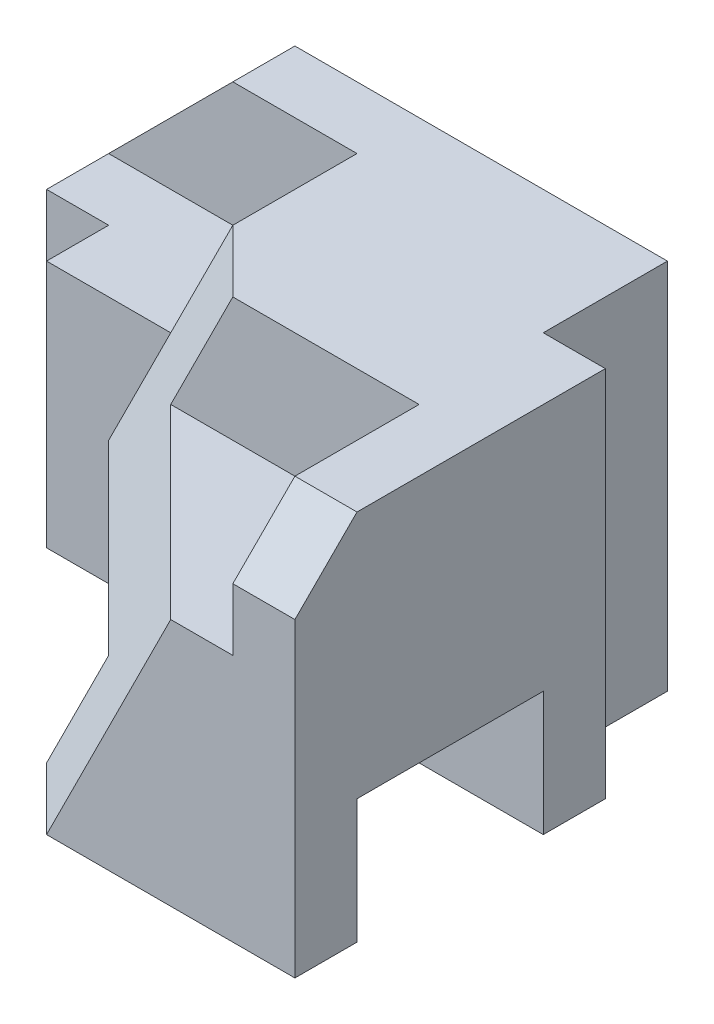
ISO-10303-21;
HEADER;
FILE_DESCRIPTION(('STEP AP214'),'2;1');
FILE_NAME('part.step','',(''),(''),'','','');
FILE_SCHEMA(('AUTOMOTIVE_DESIGN { 1 0 10303 214 1 1 1 1 }'));
ENDSEC;
DATA;
#1=APPLICATION_CONTEXT('core data for automotive mechanical design processes');
#2=APPLICATION_PROTOCOL_DEFINITION('international standard','automotive_design',2000,#1);
#3=PRODUCT_CONTEXT('',#1,'mechanical');
#4=PRODUCT('Part','Part','',(#3));
#5=PRODUCT_RELATED_PRODUCT_CATEGORY('part','',(#4));
#6=PRODUCT_DEFINITION_FORMATION('','',#4);
#7=PRODUCT_DEFINITION_CONTEXT('part definition',#1,'design');
#8=PRODUCT_DEFINITION('design','',#6,#7);
#9=PRODUCT_DEFINITION_SHAPE('','',#8);
#10=(LENGTH_UNIT() NAMED_UNIT(*) SI_UNIT(.MILLI.,.METRE.));
#11=(NAMED_UNIT(*) PLANE_ANGLE_UNIT() SI_UNIT($,.RADIAN.));
#12=(NAMED_UNIT(*) SI_UNIT($,.STERADIAN.) SOLID_ANGLE_UNIT());
#13=UNCERTAINTY_MEASURE_WITH_UNIT(LENGTH_MEASURE(1.E-05),#10,'distance_accuracy_value','');
#14=(GEOMETRIC_REPRESENTATION_CONTEXT(3) GLOBAL_UNCERTAINTY_ASSIGNED_CONTEXT((#13)) GLOBAL_UNIT_ASSIGNED_CONTEXT((#10,
#11,#12)) REPRESENTATION_CONTEXT('',''));
#15=CARTESIAN_POINT('',(0.,0.,0.));
#16=DIRECTION('',(0.,0.,1.));
#17=DIRECTION('',(1.,0.,0.));
#18=AXIS2_PLACEMENT_3D('',#15,#16,#17);
#19=CARTESIAN_POINT('',(0.,6.,0.));
#20=DIRECTION('',(0.,-1.,0.));
#21=DIRECTION('',(0.,0.,-1.));
#22=AXIS2_PLACEMENT_3D('',#19,#20,#21);
#23=PLANE('',#22);
#24=DIRECTION('',(0.707106781186548,0.,0.707106781186548));
#25=VECTOR('',#24,1.);
#26=CARTESIAN_POINT('',(0.499999999999989,6.,0.50000000000001));
#27=LINE('',#26,#25);
#28=CARTESIAN_POINT('',(-0.500000000000011,6.,-0.49999999999999));
#29=VERTEX_POINT('',#28);
#30=CARTESIAN_POINT('',(0.499999999999989,6.,0.50000000000001));
#31=VERTEX_POINT('',#30);
#32=EDGE_CURVE('E330',#29,#31,#27,.T.);
#33=ORIENTED_EDGE('',*,*,#32,.T.);
#34=DIRECTION('',(-1.,0.,0.));
#35=VECTOR('',#34,1.);
#36=CARTESIAN_POINT('',(3.49999999999998,6.,0.50000000000001));
#37=LINE('',#36,#35);
#38=CARTESIAN_POINT('',(3.49999999999998,6.,0.50000000000001));
#39=VERTEX_POINT('',#38);
#40=EDGE_CURVE('E203',#39,#31,#37,.T.);
#41=ORIENTED_EDGE('',*,*,#40,.F.);
#42=DIRECTION('',(0.,0.,-1.));
#43=VECTOR('',#42,1.);
#44=CARTESIAN_POINT('',(3.49999999999998,6.,3.50000000000001));
#45=LINE('',#44,#43);
#46=CARTESIAN_POINT('',(3.49999999999998,6.,2.50000000000001));
#47=VERTEX_POINT('',#46);
#48=EDGE_CURVE('E317',#47,#39,#45,.T.);
#49=ORIENTED_EDGE('',*,*,#48,.F.);
#50=DIRECTION('',(1.,0.,0.));
#51=VECTOR('',#50,1.);
#52=CARTESIAN_POINT('',(0.,6.,2.50000000000001));
#53=LINE('',#52,#51);
#54=CARTESIAN_POINT('',(4.5,6.,2.50000000000001));
#55=VERTEX_POINT('',#54);
#56=EDGE_CURVE('E268',#47,#55,#53,.T.);
#57=ORIENTED_EDGE('',*,*,#56,.T.);
#58=DIRECTION('',(0.,0.,-1.));
#59=VECTOR('',#58,1.);
#60=CARTESIAN_POINT('',(4.5,6.,3.50000000000001));
#61=LINE('',#60,#59);
#62=CARTESIAN_POINT('',(4.5,6.,-1.5));
#63=VERTEX_POINT('',#62);
#64=EDGE_CURVE('E246',#55,#63,#61,.T.);
#65=ORIENTED_EDGE('',*,*,#64,.T.);
#66=DIRECTION('',(1.,0.,0.));
#67=VECTOR('',#66,1.);
#68=CARTESIAN_POINT('',(4.5,6.,-1.5));
#69=LINE('',#68,#67);
#70=CARTESIAN_POINT('',(3.5,6.,-1.5));
#71=VERTEX_POINT('',#70);
#72=EDGE_CURVE('E303',#71,#63,#69,.T.);
#73=ORIENTED_EDGE('',*,*,#72,.F.);
#74=DIRECTION('',(0.,0.,1.));
#75=VECTOR('',#74,1.);
#76=CARTESIAN_POINT('',(3.5,6.,-3.5));
#77=LINE('',#76,#75);
#78=CARTESIAN_POINT('',(3.5,6.,-3.5));
#79=VERTEX_POINT('',#78);
#80=EDGE_CURVE('E298',#79,#71,#77,.T.);
#81=ORIENTED_EDGE('',*,*,#80,.F.);
#82=DIRECTION('',(-1.,0.,0.));
#83=VECTOR('',#82,1.);
#84=CARTESIAN_POINT('',(-4.50000000000001,6.,-3.5));
#85=LINE('',#84,#83);
#86=CARTESIAN_POINT('',(-2.5,6.,-3.5));
#87=VERTEX_POINT('',#86);
#88=EDGE_CURVE('E249',#79,#87,#85,.T.);
#89=ORIENTED_EDGE('',*,*,#88,.T.);
#90=DIRECTION('',(0.,0.,1.));
#91=VECTOR('',#90,1.);
#92=CARTESIAN_POINT('',(-2.5,6.,0.));
#93=LINE('',#92,#91);
#94=CARTESIAN_POINT('',(-2.5,6.,-2.49999999999999));
#95=VERTEX_POINT('',#94);
#96=EDGE_CURVE('E277',#87,#95,#93,.T.);
#97=ORIENTED_EDGE('',*,*,#96,.T.);
#98=DIRECTION('',(-1.,0.,0.));
#99=VECTOR('',#98,1.);
#100=CARTESIAN_POINT('',(-2.5,6.,-2.49999999999999));
#101=LINE('',#100,#99);
#102=CARTESIAN_POINT('',(-0.500000000000011,6.,-2.49999999999999));
#103=VERTEX_POINT('',#102);
#104=EDGE_CURVE('E53',#103,#95,#101,.T.);
#105=ORIENTED_EDGE('',*,*,#104,.F.);
#106=DIRECTION('',(0.,0.,-1.));
#107=VECTOR('',#106,1.);
#108=CARTESIAN_POINT('',(-0.500000000000011,6.,0.50000000000001));
#109=LINE('',#108,#107);
#110=EDGE_CURVE('E207',#29,#103,#109,.T.);
#111=ORIENTED_EDGE('',*,*,#110,.F.);
#112=EDGE_LOOP('',(#33,#41,#49,#57,#65,#73,#81,#89,#97,#105,#111));
#113=FACE_BOUND('',#112,.T.);
#114=ADVANCED_FACE('F36',(#113),#23,.F.);
#115=CARTESIAN_POINT('',(3.49999999999998,6.,0.50000000000001));
#116=DIRECTION('',(0.,0.,-1.));
#117=DIRECTION('',(0.,1.,0.));
#118=AXIS2_PLACEMENT_3D('',#115,#116,#117);
#119=PLANE('',#118);
#120=DIRECTION('',(-0.447213595499962,-0.894427190999914,0.));
#121=VECTOR('',#120,1.);
#122=CARTESIAN_POINT('',(-0.500000000000021,4.,0.50000000000001));
#123=LINE('',#122,#121);
#124=CARTESIAN_POINT('',(-0.500000000000021,4.,0.50000000000001));
#125=VERTEX_POINT('',#124);
#126=EDGE_CURVE('E334',#31,#125,#123,.T.);
#127=ORIENTED_EDGE('',*,*,#126,.T.);
#128=DIRECTION('',(-1.,0.,0.));
#129=VECTOR('',#128,1.);
#130=CARTESIAN_POINT('',(3.49999999999998,4.,0.50000000000001));
#131=LINE('',#130,#129);
#132=CARTESIAN_POINT('',(3.49999999999998,4.,0.50000000000001));
#133=VERTEX_POINT('',#132);
#134=EDGE_CURVE('E191',#133,#125,#131,.T.);
#135=ORIENTED_EDGE('',*,*,#134,.F.);
#136=DIRECTION('',(0.,-1.,0.));
#137=VECTOR('',#136,1.);
#138=CARTESIAN_POINT('',(3.49999999999998,6.,0.50000000000001));
#139=LINE('',#138,#137);
#140=EDGE_CURVE('E319',#39,#133,#139,.T.);
#141=ORIENTED_EDGE('',*,*,#140,.F.);
#142=ORIENTED_EDGE('',*,*,#40,.T.);
#143=EDGE_LOOP('',(#127,#135,#141,#142));
#144=FACE_BOUND('',#143,.T.);
#145=ADVANCED_FACE('F328',(#144),#119,.F.);
#146=CARTESIAN_POINT('',(0.,0.,0.));
#147=DIRECTION('',(0.,-1.,0.));
#148=DIRECTION('',(0.,0.,-1.));
#149=AXIS2_PLACEMENT_3D('',#146,#147,#148);
#150=PLANE('',#149);
#151=DIRECTION('',(1.,0.,0.));
#152=VECTOR('',#151,1.);
#153=CARTESIAN_POINT('',(-4.50000000000001,0.,3.50000000000001));
#154=LINE('',#153,#152);
#155=CARTESIAN_POINT('',(0.499999999999997,0.,3.50000000000001));
#156=VERTEX_POINT('',#155);
#157=CARTESIAN_POINT('',(4.5,0.,3.50000000000001));
#158=VERTEX_POINT('',#157);
#159=EDGE_CURVE('E223',#156,#158,#154,.T.);
#160=ORIENTED_EDGE('',*,*,#159,.F.);
#161=DIRECTION('',(-0.707106781186548,0.,-0.707106781186548));
#162=VECTOR('',#161,1.);
#163=CARTESIAN_POINT('',(0.499999999999997,0.,3.50000000000001));
#164=LINE('',#163,#162);
#165=CARTESIAN_POINT('',(-0.500000000000003,0.,2.50000000000001));
#166=VERTEX_POINT('',#165);
#167=EDGE_CURVE('E180',#156,#166,#164,.T.);
#168=ORIENTED_EDGE('',*,*,#167,.T.);
#169=DIRECTION('',(-1.,0.,0.));
#170=VECTOR('',#169,1.);
#171=CARTESIAN_POINT('',(4.5,0.,2.50000000000001));
#172=LINE('',#171,#170);
#173=CARTESIAN_POINT('',(4.5,0.,2.50000000000001));
#174=VERTEX_POINT('',#173);
#175=EDGE_CURVE('E233',#174,#166,#172,.T.);
#176=ORIENTED_EDGE('',*,*,#175,.F.);
#177=DIRECTION('',(0.,0.,-1.));
#178=VECTOR('',#177,1.);
#179=CARTESIAN_POINT('',(4.5,0.,3.50000000000001));
#180=LINE('',#179,#178);
#181=EDGE_CURVE('E253',#158,#174,#180,.T.);
#182=ORIENTED_EDGE('',*,*,#181,.F.);
#183=EDGE_LOOP('',(#160,#168,#176,#182));
#184=FACE_BOUND('',#183,.T.);
#185=ADVANCED_FACE('F395',(#184),#150,.T.);
#186=CARTESIAN_POINT('',(-4.50000000000001,6.,3.50000000000001));
#187=DIRECTION('',(0.,0.,-1.));
#188=DIRECTION('',(-1.,0.,0.));
#189=AXIS2_PLACEMENT_3D('',#186,#187,#188);
#190=PLANE('',#189);
#191=DIRECTION('',(-0.447213595499955,-0.894427190999918,0.));
#192=VECTOR('',#191,1.);
#193=CARTESIAN_POINT('',(2.49999999999998,4.,3.50000000000001));
#194=LINE('',#193,#192);
#195=CARTESIAN_POINT('',(2.49999999999998,4.,3.50000000000001));
#196=VERTEX_POINT('',#195);
#197=EDGE_CURVE('E174',#196,#156,#194,.T.);
#198=ORIENTED_EDGE('',*,*,#197,.T.);
#199=ORIENTED_EDGE('',*,*,#159,.T.);
#200=DIRECTION('',(0.,-1.,0.));
#201=VECTOR('',#200,1.);
#202=CARTESIAN_POINT('',(4.5,6.,3.50000000000001));
#203=LINE('',#202,#201);
#204=CARTESIAN_POINT('',(4.5,5.,3.50000000000001));
#205=VERTEX_POINT('',#204);
#206=EDGE_CURVE('E252',#205,#158,#203,.T.);
#207=ORIENTED_EDGE('',*,*,#206,.F.);
#208=DIRECTION('',(-1.,0.,0.));
#209=VECTOR('',#208,1.);
#210=CARTESIAN_POINT('',(-4.50000000000001,5.,3.50000000000001));
#211=LINE('',#210,#209);
#212=CARTESIAN_POINT('',(3.49999999999998,5.,3.50000000000001));
#213=VERTEX_POINT('',#212);
#214=EDGE_CURVE('E273',#205,#213,#211,.T.);
#215=ORIENTED_EDGE('',*,*,#214,.T.);
#216=DIRECTION('',(0.,1.,0.));
#217=VECTOR('',#216,1.);
#218=CARTESIAN_POINT('',(3.49999999999998,6.,3.50000000000001));
#219=LINE('',#218,#217);
#220=CARTESIAN_POINT('',(3.49999999999998,4.,3.50000000000001));
#221=VERTEX_POINT('',#220);
#222=EDGE_CURVE('E197',#221,#213,#219,.T.);
#223=ORIENTED_EDGE('',*,*,#222,.F.);
#224=DIRECTION('',(-1.,0.,0.));
#225=VECTOR('',#224,1.);
#226=CARTESIAN_POINT('',(3.49999999999998,4.,3.50000000000001));
#227=LINE('',#226,#225);
#228=EDGE_CURVE('E189',#221,#196,#227,.T.);
#229=ORIENTED_EDGE('',*,*,#228,.T.);
#230=EDGE_LOOP('',(#198,#199,#207,#215,#223,#229));
#231=FACE_BOUND('',#230,.T.);
#232=ADVANCED_FACE('F195',(#231),#190,.F.);
#233=CARTESIAN_POINT('',(4.5,0.,2.50000000000001));
#234=DIRECTION('',(0.,0.,1.));
#235=DIRECTION('',(1.,0.,0.));
#236=AXIS2_PLACEMENT_3D('',#233,#234,#235);
#237=PLANE('',#236);
#238=DIRECTION('',(0.447213595499958,0.894427190999916,0.));
#239=VECTOR('',#238,1.);
#240=CARTESIAN_POINT('',(-0.500000000000003,0.,2.50000000000001));
#241=LINE('',#240,#239);
#242=CARTESIAN_POINT('',(0.499999999999997,2.,2.50000000000001));
#243=VERTEX_POINT('',#242);
#244=EDGE_CURVE('E375',#166,#243,#241,.T.);
#245=ORIENTED_EDGE('',*,*,#244,.T.);
#246=DIRECTION('',(-1.,0.,0.));
#247=VECTOR('',#246,1.);
#248=CARTESIAN_POINT('',(4.5,2.,2.50000000000001));
#249=LINE('',#248,#247);
#250=CARTESIAN_POINT('',(4.5,2.,2.50000000000001));
#251=VERTEX_POINT('',#250);
#252=EDGE_CURVE('E229',#251,#243,#249,.T.);
#253=ORIENTED_EDGE('',*,*,#252,.F.);
#254=DIRECTION('',(0.,1.,0.));
#255=VECTOR('',#254,1.);
#256=CARTESIAN_POINT('',(4.5,0.,2.50000000000001));
#257=LINE('',#256,#255);
#258=EDGE_CURVE('E198',#174,#251,#257,.T.);
#259=ORIENTED_EDGE('',*,*,#258,.F.);
#260=ORIENTED_EDGE('',*,*,#175,.T.);
#261=EDGE_LOOP('',(#245,#253,#259,#260));
#262=FACE_BOUND('',#261,.T.);
#263=ADVANCED_FACE('F398',(#262),#237,.F.);
#264=CARTESIAN_POINT('',(4.5,2.,2.50000000000001));
#265=DIRECTION('',(0.,1.,0.));
#266=DIRECTION('',(0.,0.,1.));
#267=AXIS2_PLACEMENT_3D('',#264,#265,#266);
#268=PLANE('',#267);
#269=DIRECTION('',(-0.707106781186548,0.,-0.707106781186546));
#270=VECTOR('',#269,1.);
#271=CARTESIAN_POINT('',(0.499999999999997,2.,2.50000000000001));
#272=LINE('',#271,#270);
#273=CARTESIAN_POINT('',(-2.50000000000001,2.,-0.499999999999989));
#274=VERTEX_POINT('',#273);
#275=EDGE_CURVE('E374',#243,#274,#272,.T.);
#276=ORIENTED_EDGE('',*,*,#275,.T.);
#277=DIRECTION('',(-1.,0.,0.));
#278=VECTOR('',#277,1.);
#279=CARTESIAN_POINT('',(4.5,2.,-0.49999999999999));
#280=LINE('',#279,#278);
#281=CARTESIAN_POINT('',(4.5,2.,-0.49999999999999));
#282=VERTEX_POINT('',#281);
#283=EDGE_CURVE('E226',#282,#274,#280,.T.);
#284=ORIENTED_EDGE('',*,*,#283,.F.);
#285=DIRECTION('',(0.,0.,-1.));
#286=VECTOR('',#285,1.);
#287=CARTESIAN_POINT('',(4.5,2.,2.50000000000001));
#288=LINE('',#287,#286);
#289=EDGE_CURVE('E201',#251,#282,#288,.T.);
#290=ORIENTED_EDGE('',*,*,#289,.F.);
#291=ORIENTED_EDGE('',*,*,#252,.T.);
#292=EDGE_LOOP('',(#276,#284,#290,#291));
#293=FACE_BOUND('',#292,.T.);
#294=ADVANCED_FACE('F467',(#293),#268,.F.);
#295=CARTESIAN_POINT('',(3.49999999999998,4.,3.50000000000001));
#296=DIRECTION('',(0.,-1.,0.));
#297=DIRECTION('',(0.,0.,-1.));
#298=AXIS2_PLACEMENT_3D('',#295,#296,#297);
#299=PLANE('',#298);
#300=DIRECTION('',(0.707106781186548,0.,0.707106781186548));
#301=VECTOR('',#300,1.);
#302=CARTESIAN_POINT('',(-0.500000000000021,4.,0.50000000000001));
#303=LINE('',#302,#301);
#304=EDGE_CURVE('E177',#125,#196,#303,.T.);
#305=ORIENTED_EDGE('',*,*,#304,.T.);
#306=ORIENTED_EDGE('',*,*,#228,.F.);
#307=DIRECTION('',(0.,0.,1.));
#308=VECTOR('',#307,1.);
#309=CARTESIAN_POINT('',(3.49999999999998,4.,3.50000000000001));
#310=LINE('',#309,#308);
#311=EDGE_CURVE('E222',#133,#221,#310,.T.);
#312=ORIENTED_EDGE('',*,*,#311,.F.);
#313=ORIENTED_EDGE('',*,*,#134,.T.);
#314=EDGE_LOOP('',(#305,#306,#312,#313));
#315=FACE_BOUND('',#314,.T.);
#316=ADVANCED_FACE('F187',(#315),#299,.F.);
#317=DIRECTION('',(-1.,0.,0.));
#318=VECTOR('',#317,1.);
#319=CARTESIAN_POINT('',(-3.50000000000001,4.,-0.49999999999999));
#320=LINE('',#319,#318);
#321=CARTESIAN_POINT('',(-1.50000000000001,4.,-0.49999999999999));
#322=VERTEX_POINT('',#321);
#323=CARTESIAN_POINT('',(-3.50000000000001,4.,-0.49999999999999));
#324=VERTEX_POINT('',#323);
#325=EDGE_CURVE('E192',#322,#324,#320,.T.);
#326=ORIENTED_EDGE('',*,*,#325,.F.);
#327=DIRECTION('',(0.,0.,-1.));
#328=VECTOR('',#327,1.);
#329=CARTESIAN_POINT('',(-1.50000000000001,4.,0.50000000000001));
#330=LINE('',#329,#328);
#331=CARTESIAN_POINT('',(-1.50000000000001,4.,-2.49999999999999));
#332=VERTEX_POINT('',#331);
#333=EDGE_CURVE('E291',#322,#332,#330,.T.);
#334=ORIENTED_EDGE('',*,*,#333,.T.);
#335=DIRECTION('',(1.,0.,0.));
#336=VECTOR('',#335,1.);
#337=CARTESIAN_POINT('',(-1.50000000000001,4.,-2.49999999999999));
#338=LINE('',#337,#336);
#339=CARTESIAN_POINT('',(-4.50000000000001,4.,-2.49999999999999));
#340=VERTEX_POINT('',#339);
#341=EDGE_CURVE('E364',#340,#332,#338,.T.);
#342=ORIENTED_EDGE('',*,*,#341,.F.);
#343=DIRECTION('',(0.,0.,1.));
#344=VECTOR('',#343,1.);
#345=CARTESIAN_POINT('',(-4.50000000000001,4.,3.50000000000001));
#346=LINE('',#345,#344);
#347=CARTESIAN_POINT('',(-4.50000000000001,4.,-1.49999999999999));
#348=VERTEX_POINT('',#347);
#349=EDGE_CURVE('E213',#340,#348,#346,.T.);
#350=ORIENTED_EDGE('',*,*,#349,.T.);
#351=DIRECTION('',(-1.,0.,0.));
#352=VECTOR('',#351,1.);
#353=CARTESIAN_POINT('',(-4.50000000000001,4.,-1.49999999999999));
#354=LINE('',#353,#352);
#355=CARTESIAN_POINT('',(-3.50000000000001,4.,-1.49999999999999));
#356=VERTEX_POINT('',#355);
#357=EDGE_CURVE('E350',#356,#348,#354,.T.);
#358=ORIENTED_EDGE('',*,*,#357,.F.);
#359=DIRECTION('',(0.,0.,-1.));
#360=VECTOR('',#359,1.);
#361=CARTESIAN_POINT('',(-3.50000000000001,4.,-1.49999999999999));
#362=LINE('',#361,#360);
#363=EDGE_CURVE('E347',#324,#356,#362,.T.);
#364=ORIENTED_EDGE('',*,*,#363,.F.);
#365=EDGE_LOOP('',(#326,#334,#342,#350,#358,#364));
#366=FACE_BOUND('',#365,.T.);
#367=ADVANCED_FACE('F455',(#366),#299,.F.);
#368=CARTESIAN_POINT('',(-0.500000000000011,6.,0.50000000000001));
#369=DIRECTION('',(-0.894427190999916,0.447213595499958,0.));
#370=DIRECTION('',(-0.447213595499958,-0.894427190999916,0.));
#371=AXIS2_PLACEMENT_3D('',#368,#369,#370);
#372=PLANE('',#371);
#373=ORIENTED_EDGE('',*,*,#333,.F.);
#374=DIRECTION('',(0.447213595499958,0.894427190999916,0.));
#375=VECTOR('',#374,1.);
#376=CARTESIAN_POINT('',(-0.500000000000011,6.,-0.49999999999999));
#377=LINE('',#376,#375);
#378=EDGE_CURVE('E333',#322,#29,#377,.T.);
#379=ORIENTED_EDGE('',*,*,#378,.T.);
#380=ORIENTED_EDGE('',*,*,#110,.T.);
#381=DIRECTION('',(0.447213595499958,0.894427190999916,0.));
#382=VECTOR('',#381,1.);
#383=CARTESIAN_POINT('',(-0.500000000000011,6.,-2.49999999999999));
#384=LINE('',#383,#382);
#385=EDGE_CURVE('E292',#332,#103,#384,.T.);
#386=ORIENTED_EDGE('',*,*,#385,.F.);
#387=EDGE_LOOP('',(#373,#379,#380,#386));
#388=FACE_BOUND('',#387,.T.);
#389=ADVANCED_FACE('F370',(#388),#372,.T.);
#390=CARTESIAN_POINT('',(-2.5,6.,0.));
#391=DIRECTION('',(0.707106781186548,-0.707106781186548,0.));
#392=DIRECTION('',(0.,0.,1.));
#393=AXIS2_PLACEMENT_3D('',#390,#391,#392);
#394=PLANE('',#393);
#395=DIRECTION('',(0.,0.,-1.));
#396=VECTOR('',#395,1.);
#397=CARTESIAN_POINT('',(-4.50000000000001,3.99999999999999,3.50000000000001));
#398=LINE('',#397,#396);
#399=CARTESIAN_POINT('',(-4.50000000000001,3.99999999999999,-3.5));
#400=VERTEX_POINT('',#399);
#401=EDGE_CURVE('E45',#340,#400,#398,.T.);
#402=ORIENTED_EDGE('',*,*,#401,.F.);
#403=DIRECTION('',(-0.707106781186549,-0.707106781186546,0.));
#404=VECTOR('',#403,1.);
#405=CARTESIAN_POINT('',(-4.50000000000001,4.,-2.49999999999999));
#406=LINE('',#405,#404);
#407=EDGE_CURVE('E288',#95,#340,#406,.T.);
#408=ORIENTED_EDGE('',*,*,#407,.F.);
#409=ORIENTED_EDGE('',*,*,#96,.F.);
#410=DIRECTION('',(-0.707106781186548,-0.707106781186548,0.));
#411=VECTOR('',#410,1.);
#412=CARTESIAN_POINT('',(-2.5,6.,-3.5));
#413=LINE('',#412,#411);
#414=EDGE_CURVE('E12',#400,#87,#413,.F.);
#415=ORIENTED_EDGE('',*,*,#414,.F.);
#416=EDGE_LOOP('',(#402,#408,#409,#415));
#417=FACE_BOUND('',#416,.T.);
#418=ADVANCED_FACE('F38',(#417),#394,.F.);
#419=CARTESIAN_POINT('',(4.5,6.,3.50000000000001));
#420=DIRECTION('',(-1.,0.,0.));
#421=DIRECTION('',(0.,0.,1.));
#422=AXIS2_PLACEMENT_3D('',#419,#420,#421);
#423=PLANE('',#422);
#424=CARTESIAN_POINT('',(4.5,0.,-0.49999999999999));
#425=VERTEX_POINT('',#424);
#426=CARTESIAN_POINT('',(4.5,0.,-1.5));
#427=VERTEX_POINT('',#426);
#428=EDGE_CURVE('E257',#425,#427,#180,.T.);
#429=ORIENTED_EDGE('',*,*,#428,.T.);
#430=DIRECTION('',(0.,1.,0.));
#431=VECTOR('',#430,1.);
#432=CARTESIAN_POINT('',(4.5,0.,-1.5));
#433=LINE('',#432,#431);
#434=EDGE_CURVE('E310',#427,#63,#433,.T.);
#435=ORIENTED_EDGE('',*,*,#434,.T.);
#436=ORIENTED_EDGE('',*,*,#64,.F.);
#437=DIRECTION('',(0.,0.707106781186548,-0.707106781186548));
#438=VECTOR('',#437,1.);
#439=CARTESIAN_POINT('',(4.5,6.,2.50000000000001));
#440=LINE('',#439,#438);
#441=EDGE_CURVE('E271',#55,#205,#440,.F.);
#442=ORIENTED_EDGE('',*,*,#441,.T.);
#443=ORIENTED_EDGE('',*,*,#206,.T.);
#444=ORIENTED_EDGE('',*,*,#181,.T.);
#445=ORIENTED_EDGE('',*,*,#258,.T.);
#446=ORIENTED_EDGE('',*,*,#289,.T.);
#447=DIRECTION('',(0.,-1.,0.));
#448=VECTOR('',#447,1.);
#449=CARTESIAN_POINT('',(4.5,0.,-0.49999999999999));
#450=LINE('',#449,#448);
#451=EDGE_CURVE('E236',#282,#425,#450,.T.);
#452=ORIENTED_EDGE('',*,*,#451,.T.);
#453=EDGE_LOOP('',(#429,#435,#436,#442,#443,#444,#445,#446,#452));
#454=FACE_BOUND('',#453,.T.);
#455=ADVANCED_FACE('F402',(#454),#423,.F.);
#456=CARTESIAN_POINT('',(-4.50000000000001,6.,-3.5));
#457=DIRECTION('',(0.,0.,1.));
#458=DIRECTION('',(1.,0.,0.));
#459=AXIS2_PLACEMENT_3D('',#456,#457,#458);
#460=PLANE('',#459);
#461=DIRECTION('',(0.,-1.,0.));
#462=VECTOR('',#461,1.);
#463=CARTESIAN_POINT('',(-4.50000000000001,6.,-3.5));
#464=LINE('',#463,#462);
#465=CARTESIAN_POINT('',(-4.50000000000001,0.,-3.5));
#466=VERTEX_POINT('',#465);
#467=EDGE_CURVE('E266',#400,#466,#464,.T.);
#468=ORIENTED_EDGE('',*,*,#467,.F.);
#469=ORIENTED_EDGE('',*,*,#414,.T.);
#470=ORIENTED_EDGE('',*,*,#88,.F.);
#471=DIRECTION('',(0.,1.,0.));
#472=VECTOR('',#471,1.);
#473=CARTESIAN_POINT('',(3.5,0.,-3.5));
#474=LINE('',#473,#472);
#475=CARTESIAN_POINT('',(3.5,0.,-3.5));
#476=VERTEX_POINT('',#475);
#477=EDGE_CURVE('E306',#476,#79,#474,.T.);
#478=ORIENTED_EDGE('',*,*,#477,.F.);
#479=DIRECTION('',(-1.,0.,0.));
#480=VECTOR('',#479,1.);
#481=CARTESIAN_POINT('',(-4.50000000000001,0.,-3.5));
#482=LINE('',#481,#480);
#483=EDGE_CURVE('E256',#476,#466,#482,.T.);
#484=ORIENTED_EDGE('',*,*,#483,.T.);
#485=EDGE_LOOP('',(#468,#469,#470,#478,#484));
#486=FACE_BOUND('',#485,.T.);
#487=ADVANCED_FACE('F445',(#486),#460,.F.);
#488=CARTESIAN_POINT('',(-4.50000000000001,6.,3.50000000000001));
#489=DIRECTION('',(1.,0.,0.));
#490=DIRECTION('',(0.,0.,-1.));
#491=AXIS2_PLACEMENT_3D('',#488,#489,#490);
#492=PLANE('',#491);
#493=DIRECTION('',(0.,0.,1.));
#494=VECTOR('',#493,1.);
#495=CARTESIAN_POINT('',(-4.50000000000001,0.,3.50000000000001));
#496=LINE('',#495,#494);
#497=CARTESIAN_POINT('',(-4.50000000000001,0.,-1.49999999999999));
#498=VERTEX_POINT('',#497);
#499=EDGE_CURVE('E260',#466,#498,#496,.T.);
#500=ORIENTED_EDGE('',*,*,#499,.T.);
#501=DIRECTION('',(0.,1.,0.));
#502=VECTOR('',#501,1.);
#503=CARTESIAN_POINT('',(-4.50000000000001,-1.09405423330969,-1.49999999999999));
#504=LINE('',#503,#502);
#505=EDGE_CURVE('E353',#498,#348,#504,.T.);
#506=ORIENTED_EDGE('',*,*,#505,.T.);
#507=ORIENTED_EDGE('',*,*,#349,.F.);
#508=ORIENTED_EDGE('',*,*,#401,.T.);
#509=ORIENTED_EDGE('',*,*,#467,.T.);
#510=EDGE_LOOP('',(#500,#506,#507,#508,#509));
#511=FACE_BOUND('',#510,.T.);
#512=ADVANCED_FACE('F440',(#511),#492,.F.);
#513=DIRECTION('',(1.,0.,0.));
#514=VECTOR('',#513,1.);
#515=CARTESIAN_POINT('',(0.,0.,-1.49999999999999));
#516=LINE('',#515,#514);
#517=CARTESIAN_POINT('',(-3.50000000000001,0.,-1.49999999999999));
#518=VERTEX_POINT('',#517);
#519=EDGE_CURVE('E362',#498,#518,#516,.T.);
#520=ORIENTED_EDGE('',*,*,#519,.F.);
#521=ORIENTED_EDGE('',*,*,#499,.F.);
#522=ORIENTED_EDGE('',*,*,#483,.F.);
#523=DIRECTION('',(0.,0.,1.));
#524=VECTOR('',#523,1.);
#525=CARTESIAN_POINT('',(3.5,0.,-3.5));
#526=LINE('',#525,#524);
#527=CARTESIAN_POINT('',(3.5,0.,-1.5));
#528=VERTEX_POINT('',#527);
#529=EDGE_CURVE('E299',#476,#528,#526,.T.);
#530=ORIENTED_EDGE('',*,*,#529,.T.);
#531=DIRECTION('',(1.,0.,0.));
#532=VECTOR('',#531,1.);
#533=CARTESIAN_POINT('',(4.5,0.,-1.5));
#534=LINE('',#533,#532);
#535=EDGE_CURVE('E302',#528,#427,#534,.T.);
#536=ORIENTED_EDGE('',*,*,#535,.T.);
#537=ORIENTED_EDGE('',*,*,#428,.F.);
#538=DIRECTION('',(-1.,0.,0.));
#539=VECTOR('',#538,1.);
#540=CARTESIAN_POINT('',(4.5,0.,-0.49999999999999));
#541=LINE('',#540,#539);
#542=CARTESIAN_POINT('',(-3.50000000000001,0.,-0.49999999999999));
#543=VERTEX_POINT('',#542);
#544=EDGE_CURVE('E228',#425,#543,#541,.T.);
#545=ORIENTED_EDGE('',*,*,#544,.T.);
#546=DIRECTION('',(0.,0.,1.));
#547=VECTOR('',#546,1.);
#548=CARTESIAN_POINT('',(-3.50000000000001,0.,0.));
#549=LINE('',#548,#547);
#550=EDGE_CURVE('E356',#518,#543,#549,.T.);
#551=ORIENTED_EDGE('',*,*,#550,.F.);
#552=EDGE_LOOP('',(#520,#521,#522,#530,#536,#537,#545,#551));
#553=FACE_BOUND('',#552,.T.);
#554=ADVANCED_FACE('F407',(#553),#150,.T.);
#555=CARTESIAN_POINT('',(4.5,0.,-0.49999999999999));
#556=DIRECTION('',(0.,0.,-1.));
#557=DIRECTION('',(-1.,0.,0.));
#558=AXIS2_PLACEMENT_3D('',#555,#556,#557);
#559=PLANE('',#558);
#560=ORIENTED_EDGE('',*,*,#325,.T.);
#561=DIRECTION('',(0.,1.,0.));
#562=VECTOR('',#561,1.);
#563=CARTESIAN_POINT('',(-3.50000000000001,-1.09405423330969,-0.49999999999999));
#564=LINE('',#563,#562);
#565=EDGE_CURVE('E352',#543,#324,#564,.T.);
#566=ORIENTED_EDGE('',*,*,#565,.F.);
#567=ORIENTED_EDGE('',*,*,#544,.F.);
#568=ORIENTED_EDGE('',*,*,#451,.F.);
#569=ORIENTED_EDGE('',*,*,#283,.T.);
#570=EDGE_CURVE('E336',#274,#322,#377,.T.);
#571=ORIENTED_EDGE('',*,*,#570,.T.);
#572=EDGE_LOOP('',(#560,#566,#567,#568,#569,#571));
#573=FACE_BOUND('',#572,.T.);
#574=ADVANCED_FACE('F371',(#573),#559,.F.);
#575=CARTESIAN_POINT('',(3.49999999999998,0.,0.));
#576=DIRECTION('',(1.,0.,0.));
#577=DIRECTION('',(0.,0.,-1.));
#578=AXIS2_PLACEMENT_3D('',#575,#576,#577);
#579=PLANE('',#578);
#580=ORIENTED_EDGE('',*,*,#222,.T.);
#581=DIRECTION('',(0.,-0.707106781186548,0.707106781186548));
#582=VECTOR('',#581,1.);
#583=CARTESIAN_POINT('',(3.49999999999998,6.,2.50000000000001));
#584=LINE('',#583,#582);
#585=EDGE_CURVE('E275',#213,#47,#584,.F.);
#586=ORIENTED_EDGE('',*,*,#585,.T.);
#587=ORIENTED_EDGE('',*,*,#48,.T.);
#588=ORIENTED_EDGE('',*,*,#140,.T.);
#589=ORIENTED_EDGE('',*,*,#311,.T.);
#590=EDGE_LOOP('',(#580,#586,#587,#588,#589));
#591=FACE_BOUND('',#590,.T.);
#592=ADVANCED_FACE('F322',(#591),#579,.F.);
#593=CARTESIAN_POINT('',(0.,6.,2.50000000000001));
#594=DIRECTION('',(0.,-0.707106781186548,-0.707106781186548));
#595=DIRECTION('',(1.,0.,0.));
#596=AXIS2_PLACEMENT_3D('',#593,#594,#595);
#597=PLANE('',#596);
#598=ORIENTED_EDGE('',*,*,#585,.F.);
#599=ORIENTED_EDGE('',*,*,#214,.F.);
#600=ORIENTED_EDGE('',*,*,#441,.F.);
#601=ORIENTED_EDGE('',*,*,#56,.F.);
#602=EDGE_LOOP('',(#598,#599,#600,#601));
#603=FACE_BOUND('',#602,.T.);
#604=ADVANCED_FACE('F420',(#603),#597,.F.);
#605=CARTESIAN_POINT('',(4.5,0.,-1.5));
#606=DIRECTION('',(0.,0.,1.));
#607=DIRECTION('',(1.,0.,0.));
#608=AXIS2_PLACEMENT_3D('',#605,#606,#607);
#609=PLANE('',#608);
#610=ORIENTED_EDGE('',*,*,#72,.T.);
#611=ORIENTED_EDGE('',*,*,#434,.F.);
#612=ORIENTED_EDGE('',*,*,#535,.F.);
#613=DIRECTION('',(0.,1.,0.));
#614=VECTOR('',#613,1.);
#615=CARTESIAN_POINT('',(3.5,0.,-1.5));
#616=LINE('',#615,#614);
#617=EDGE_CURVE('E313',#528,#71,#616,.T.);
#618=ORIENTED_EDGE('',*,*,#617,.T.);
#619=EDGE_LOOP('',(#610,#611,#612,#618));
#620=FACE_BOUND('',#619,.T.);
#621=ADVANCED_FACE('F412',(#620),#609,.F.);
#622=CARTESIAN_POINT('',(3.5,0.,-3.5));
#623=DIRECTION('',(-1.,0.,0.));
#624=DIRECTION('',(0.,0.,1.));
#625=AXIS2_PLACEMENT_3D('',#622,#623,#624);
#626=PLANE('',#625);
#627=ORIENTED_EDGE('',*,*,#80,.T.);
#628=ORIENTED_EDGE('',*,*,#617,.F.);
#629=ORIENTED_EDGE('',*,*,#529,.F.);
#630=ORIENTED_EDGE('',*,*,#477,.T.);
#631=EDGE_LOOP('',(#627,#628,#629,#630));
#632=FACE_BOUND('',#631,.T.);
#633=ADVANCED_FACE('F414',(#632),#626,.F.);
#634=CARTESIAN_POINT('',(0.,0.,-2.49999999999999));
#635=DIRECTION('',(0.,0.,1.));
#636=DIRECTION('',(1.,0.,0.));
#637=AXIS2_PLACEMENT_3D('',#634,#635,#636);
#638=PLANE('',#637);
#639=ORIENTED_EDGE('',*,*,#341,.T.);
#640=ORIENTED_EDGE('',*,*,#385,.T.);
#641=ORIENTED_EDGE('',*,*,#104,.T.);
#642=ORIENTED_EDGE('',*,*,#407,.T.);
#643=EDGE_LOOP('',(#639,#640,#641,#642));
#644=FACE_BOUND('',#643,.T.);
#645=ADVANCED_FACE('F366',(#644),#638,.T.);
#646=CARTESIAN_POINT('',(-4.50000000000001,-1.09405423330969,-1.49999999999999));
#647=DIRECTION('',(0.,0.,-1.));
#648=DIRECTION('',(-1.,0.,0.));
#649=AXIS2_PLACEMENT_3D('',#646,#647,#648);
#650=PLANE('',#649);
#651=ORIENTED_EDGE('',*,*,#519,.T.);
#652=DIRECTION('',(0.,1.,0.));
#653=VECTOR('',#652,1.);
#654=CARTESIAN_POINT('',(-3.50000000000001,-1.09405423330969,-1.49999999999999));
#655=LINE('',#654,#653);
#656=EDGE_CURVE('E357',#518,#356,#655,.T.);
#657=ORIENTED_EDGE('',*,*,#656,.T.);
#658=ORIENTED_EDGE('',*,*,#357,.T.);
#659=ORIENTED_EDGE('',*,*,#505,.F.);
#660=EDGE_LOOP('',(#651,#657,#658,#659));
#661=FACE_BOUND('',#660,.T.);
#662=ADVANCED_FACE('F482',(#661),#650,.F.);
#663=CARTESIAN_POINT('',(-3.50000000000001,-1.09405423330969,-1.49999999999999));
#664=DIRECTION('',(1.,0.,0.));
#665=DIRECTION('',(0.,0.,-1.));
#666=AXIS2_PLACEMENT_3D('',#663,#664,#665);
#667=PLANE('',#666);
#668=ORIENTED_EDGE('',*,*,#550,.T.);
#669=ORIENTED_EDGE('',*,*,#565,.T.);
#670=ORIENTED_EDGE('',*,*,#363,.T.);
#671=ORIENTED_EDGE('',*,*,#656,.F.);
#672=EDGE_LOOP('',(#668,#669,#670,#671));
#673=FACE_BOUND('',#672,.T.);
#674=ADVANCED_FACE('F477',(#673),#667,.F.);
#675=CARTESIAN_POINT('',(-1.33333333333334,0.666666666666665,1.33333333333334));
#676=DIRECTION('',(-0.666666666666668,0.333333333333332,0.666666666666667));
#677=DIRECTION('',(0.707106781186547,0.,0.707106781186548));
#678=AXIS2_PLACEMENT_3D('',#675,#676,#677);
#679=PLANE('',#678);
#680=ORIENTED_EDGE('',*,*,#304,.F.);
#681=ORIENTED_EDGE('',*,*,#126,.F.);
#682=ORIENTED_EDGE('',*,*,#32,.F.);
#683=ORIENTED_EDGE('',*,*,#378,.F.);
#684=ORIENTED_EDGE('',*,*,#570,.F.);
#685=ORIENTED_EDGE('',*,*,#275,.F.);
#686=ORIENTED_EDGE('',*,*,#244,.F.);
#687=ORIENTED_EDGE('',*,*,#167,.F.);
#688=ORIENTED_EDGE('',*,*,#197,.F.);
#689=EDGE_LOOP('',(#680,#681,#682,#683,#684,#685,#686,#687,#688));
#690=FACE_BOUND('',#689,.T.);
#691=ADVANCED_FACE('F176',(#690),#679,.T.);
#692=CLOSED_SHELL('',(#114,#145,#185,#232,#263,#294,#316,#367,#389,#418,#455,#487,#512,#554,
#574,#592,#604,#621,#633,#645,#662,#674,#691));
#693=MANIFOLD_SOLID_BREP('B2',#692);
#694=ADVANCED_BREP_SHAPE_REPRESENTATION('',(#18,#693),#14);
#695=SHAPE_DEFINITION_REPRESENTATION(#9,#694);
ENDSEC;
END-ISO-10303-21;
